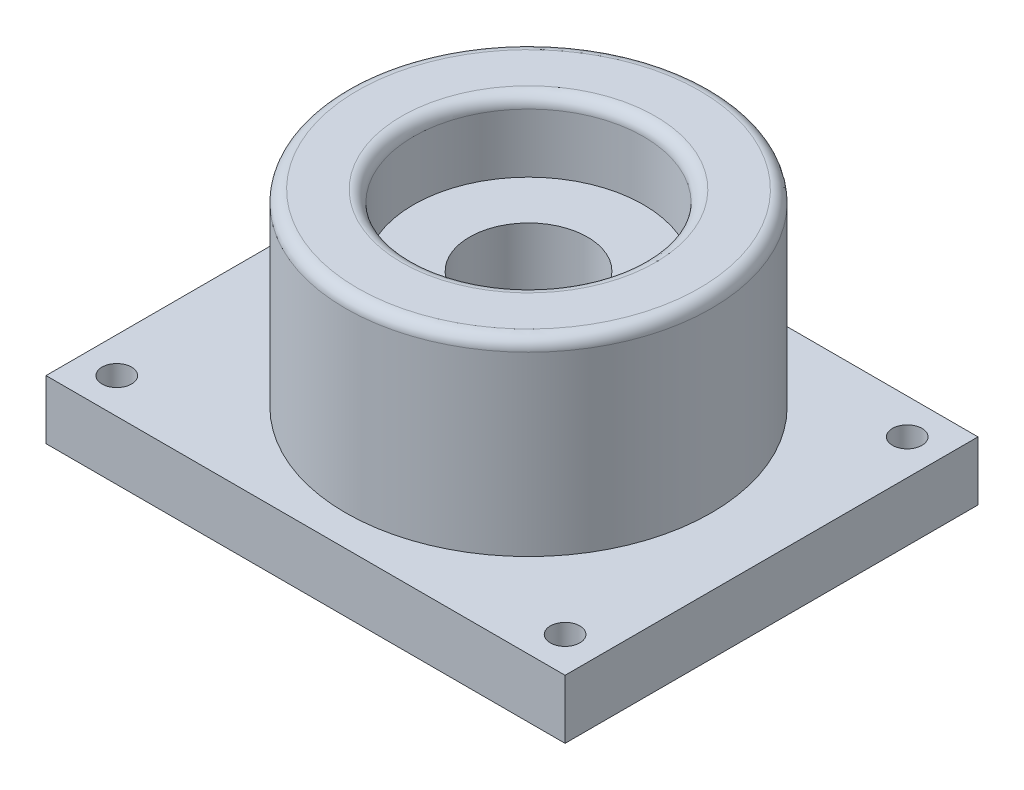
ISO-10303-21;
HEADER;
FILE_DESCRIPTION(('STEP AP214'),'2;1');
FILE_NAME('part.step','',(''),(''),'','','');
FILE_SCHEMA(('AUTOMOTIVE_DESIGN { 1 0 10303 214 1 1 1 1 }'));
ENDSEC;
DATA;
#1=APPLICATION_CONTEXT('core data for automotive mechanical design processes');
#2=APPLICATION_PROTOCOL_DEFINITION('international standard','automotive_design',2000,#1);
#3=PRODUCT_CONTEXT('',#1,'mechanical');
#4=PRODUCT('Part','Part','',(#3));
#5=PRODUCT_RELATED_PRODUCT_CATEGORY('part','',(#4));
#6=PRODUCT_DEFINITION_FORMATION('','',#4);
#7=PRODUCT_DEFINITION_CONTEXT('part definition',#1,'design');
#8=PRODUCT_DEFINITION('design','',#6,#7);
#9=PRODUCT_DEFINITION_SHAPE('','',#8);
#10=(LENGTH_UNIT() NAMED_UNIT(*) SI_UNIT(.MILLI.,.METRE.));
#11=(NAMED_UNIT(*) PLANE_ANGLE_UNIT() SI_UNIT($,.RADIAN.));
#12=(NAMED_UNIT(*) SI_UNIT($,.STERADIAN.) SOLID_ANGLE_UNIT());
#13=UNCERTAINTY_MEASURE_WITH_UNIT(LENGTH_MEASURE(1.E-05),#10,'distance_accuracy_value','');
#14=(GEOMETRIC_REPRESENTATION_CONTEXT(3) GLOBAL_UNCERTAINTY_ASSIGNED_CONTEXT((#13)) GLOBAL_UNIT_ASSIGNED_CONTEXT((#10,
#11,#12)) REPRESENTATION_CONTEXT('',''));
#15=CARTESIAN_POINT('',(0.,0.,0.));
#16=DIRECTION('',(0.,0.,1.));
#17=DIRECTION('',(1.,0.,0.));
#18=AXIS2_PLACEMENT_3D('',#15,#16,#17);
#19=CARTESIAN_POINT('',(0.,16.,0.));
#20=DIRECTION('',(0.,-1.,0.));
#21=DIRECTION('',(0.,0.,-1.));
#22=AXIS2_PLACEMENT_3D('',#19,#20,#21);
#23=CYLINDRICAL_SURFACE('',#22,15.5);
#24=CARTESIAN_POINT('',(0.,15.,0.));
#25=DIRECTION('',(0.,1.,0.));
#26=DIRECTION('',(0.,0.,1.));
#27=AXIS2_PLACEMENT_3D('',#24,#25,#26);
#28=CIRCLE('',#27,15.5);
#29=CARTESIAN_POINT('',(0.,15.,15.5));
#30=VERTEX_POINT('',#29);
#31=EDGE_CURVE('E11',#30,#30,#28,.F.);
#32=ORIENTED_EDGE('',*,*,#31,.T.);
#33=EDGE_LOOP('',(#32));
#34=FACE_BOUND('',#33,.T.);
#35=CARTESIAN_POINT('',(0.,0.,0.));
#36=DIRECTION('',(0.,1.,0.));
#37=DIRECTION('',(0.,0.,1.));
#38=AXIS2_PLACEMENT_3D('',#35,#36,#37);
#39=CIRCLE('',#38,15.5);
#40=CARTESIAN_POINT('',(0.,0.,15.5));
#41=VERTEX_POINT('',#40);
#42=EDGE_CURVE('E112',#41,#41,#39,.T.);
#43=ORIENTED_EDGE('',*,*,#42,.T.);
#44=EDGE_LOOP('',(#43));
#45=FACE_BOUND('',#44,.T.);
#46=ADVANCED_FACE('F33',(#34,#45),#23,.T.);
#47=CARTESIAN_POINT('',(0.,16.,0.));
#48=DIRECTION('',(0.,1.,0.));
#49=DIRECTION('',(0.,0.,1.));
#50=AXIS2_PLACEMENT_3D('',#47,#48,#49);
#51=PLANE('',#50);
#52=CARTESIAN_POINT('',(0.,16.,0.));
#53=DIRECTION('',(0.,1.,0.));
#54=DIRECTION('',(0.,0.,1.));
#55=AXIS2_PLACEMENT_3D('',#52,#53,#54);
#56=CIRCLE('',#55,14.5);
#57=CARTESIAN_POINT('',(0.,16.,14.5));
#58=VERTEX_POINT('',#57);
#59=EDGE_CURVE('E42',#58,#58,#56,.T.);
#60=ORIENTED_EDGE('',*,*,#59,.T.);
#61=EDGE_LOOP('',(#60));
#62=FACE_BOUND('',#61,.T.);
#63=CARTESIAN_POINT('',(0.,16.,0.));
#64=DIRECTION('',(0.,1.,0.));
#65=DIRECTION('',(0.,0.,1.));
#66=AXIS2_PLACEMENT_3D('',#63,#64,#65);
#67=CIRCLE('',#66,10.75);
#68=CARTESIAN_POINT('',(0.,16.,10.75));
#69=VERTEX_POINT('',#68);
#70=EDGE_CURVE('E123',#69,#69,#67,.F.);
#71=ORIENTED_EDGE('',*,*,#70,.T.);
#72=EDGE_LOOP('',(#71));
#73=FACE_BOUND('',#72,.T.);
#74=ADVANCED_FACE('F128',(#62,#73),#51,.T.);
#75=CARTESIAN_POINT('',(0.,-5.,0.));
#76=DIRECTION('',(0.,-1.,0.));
#77=DIRECTION('',(0.,0.,-1.));
#78=AXIS2_PLACEMENT_3D('',#75,#76,#77);
#79=PLANE('',#78);
#80=CARTESIAN_POINT('',(0.,-5.,0.));
#81=DIRECTION('',(0.,-1.,0.));
#82=DIRECTION('',(0.,0.,-1.));
#83=AXIS2_PLACEMENT_3D('',#80,#81,#82);
#84=CIRCLE('',#83,5.);
#85=CARTESIAN_POINT('',(0.,-5.,-5.));
#86=VERTEX_POINT('',#85);
#87=EDGE_CURVE('E116',#86,#86,#84,.T.);
#88=ORIENTED_EDGE('',*,*,#87,.F.);
#89=EDGE_LOOP('',(#88));
#90=FACE_BOUND('',#89,.T.);
#91=CARTESIAN_POINT('',(18.220707153394,-5.,15.1198920370729));
#92=DIRECTION('',(0.,-1.,0.));
#93=DIRECTION('',(0.,0.,-1.));
#94=AXIS2_PLACEMENT_3D('',#91,#92,#93);
#95=CIRCLE('',#94,1.25);
#96=CARTESIAN_POINT('',(18.220707153394,-5.,13.8698920370729));
#97=VERTEX_POINT('',#96);
#98=EDGE_CURVE('E210',#97,#97,#95,.T.);
#99=ORIENTED_EDGE('',*,*,#98,.F.);
#100=EDGE_LOOP('',(#99));
#101=FACE_BOUND('',#100,.T.);
#102=CARTESIAN_POINT('',(-19.7792928466059,-5.,-13.8801079629271));
#103=DIRECTION('',(0.,-1.,0.));
#104=DIRECTION('',(0.,0.,-1.));
#105=AXIS2_PLACEMENT_3D('',#102,#103,#104);
#106=CIRCLE('',#105,1.25);
#107=CARTESIAN_POINT('',(-19.7792928466059,-5.,-15.1301079629271));
#108=VERTEX_POINT('',#107);
#109=EDGE_CURVE('E105',#108,#108,#106,.T.);
#110=ORIENTED_EDGE('',*,*,#109,.F.);
#111=EDGE_LOOP('',(#110));
#112=FACE_BOUND('',#111,.T.);
#113=DIRECTION('',(0.,0.,1.));
#114=VECTOR('',#113,1.);
#115=CARTESIAN_POINT('',(21.2207071533941,-5.,18.1198920370729));
#116=LINE('',#115,#114);
#117=CARTESIAN_POINT('',(21.2207071533941,-5.,-16.8801079629271));
#118=VERTEX_POINT('',#117);
#119=CARTESIAN_POINT('',(21.2207071533941,-5.,18.1198920370729));
#120=VERTEX_POINT('',#119);
#121=EDGE_CURVE('E87',#118,#120,#116,.T.);
#122=ORIENTED_EDGE('',*,*,#121,.T.);
#123=DIRECTION('',(-1.,0.,0.));
#124=VECTOR('',#123,1.);
#125=CARTESIAN_POINT('',(-22.7792928466059,-5.,18.1198920370729));
#126=LINE('',#125,#124);
#127=CARTESIAN_POINT('',(-22.7792928466059,-5.,18.1198920370729));
#128=VERTEX_POINT('',#127);
#129=EDGE_CURVE('E81',#120,#128,#126,.T.);
#130=ORIENTED_EDGE('',*,*,#129,.T.);
#131=DIRECTION('',(0.,0.,-1.));
#132=VECTOR('',#131,1.);
#133=CARTESIAN_POINT('',(-22.7792928466059,-5.,18.1198920370729));
#134=LINE('',#133,#132);
#135=CARTESIAN_POINT('',(-22.7792928466059,-5.,-16.8801079629271));
#136=VERTEX_POINT('',#135);
#137=EDGE_CURVE('E85',#128,#136,#134,.T.);
#138=ORIENTED_EDGE('',*,*,#137,.T.);
#139=DIRECTION('',(1.,0.,0.));
#140=VECTOR('',#139,1.);
#141=CARTESIAN_POINT('',(-22.7792928466059,-5.,-16.8801079629271));
#142=LINE('',#141,#140);
#143=EDGE_CURVE('E50',#136,#118,#142,.T.);
#144=ORIENTED_EDGE('',*,*,#143,.T.);
#145=EDGE_LOOP('',(#122,#130,#138,#144));
#146=FACE_BOUND('',#145,.T.);
#147=CARTESIAN_POINT('',(18.2207071533941,-5.,-13.8801079629271));
#148=DIRECTION('',(0.,-1.,0.));
#149=DIRECTION('',(0.,0.,-1.));
#150=AXIS2_PLACEMENT_3D('',#147,#148,#149);
#151=CIRCLE('',#150,1.25);
#152=CARTESIAN_POINT('',(18.2207071533941,-5.,-15.1301079629271));
#153=VERTEX_POINT('',#152);
#154=EDGE_CURVE('E216',#153,#153,#151,.T.);
#155=ORIENTED_EDGE('',*,*,#154,.F.);
#156=EDGE_LOOP('',(#155));
#157=FACE_BOUND('',#156,.T.);
#158=CARTESIAN_POINT('',(-19.779292846606,-5.,15.1198920370729));
#159=DIRECTION('',(0.,-1.,0.));
#160=DIRECTION('',(0.,0.,-1.));
#161=AXIS2_PLACEMENT_3D('',#158,#159,#160);
#162=CIRCLE('',#161,1.25);
#163=CARTESIAN_POINT('',(-19.779292846606,-5.,13.8698920370729));
#164=VERTEX_POINT('',#163);
#165=EDGE_CURVE('E204',#164,#164,#162,.T.);
#166=ORIENTED_EDGE('',*,*,#165,.F.);
#167=EDGE_LOOP('',(#166));
#168=FACE_BOUND('',#167,.T.);
#169=ADVANCED_FACE('F82',(#90,#101,#112,#146,#157,#168),#79,.T.);
#170=CARTESIAN_POINT('',(0.,0.,0.));
#171=DIRECTION('',(0.,-1.,0.));
#172=DIRECTION('',(0.,0.,-1.));
#173=AXIS2_PLACEMENT_3D('',#170,#171,#172);
#174=PLANE('',#173);
#175=ORIENTED_EDGE('',*,*,#42,.F.);
#176=EDGE_LOOP('',(#175));
#177=FACE_BOUND('',#176,.T.);
#178=DIRECTION('',(0.,0.,1.));
#179=VECTOR('',#178,1.);
#180=CARTESIAN_POINT('',(21.2207071533941,0.,18.1198920370729));
#181=LINE('',#180,#179);
#182=CARTESIAN_POINT('',(21.2207071533941,0.,-16.8801079629271));
#183=VERTEX_POINT('',#182);
#184=CARTESIAN_POINT('',(21.2207071533941,0.,18.1198920370729));
#185=VERTEX_POINT('',#184);
#186=EDGE_CURVE('E102',#183,#185,#181,.T.);
#187=ORIENTED_EDGE('',*,*,#186,.F.);
#188=DIRECTION('',(1.,0.,0.));
#189=VECTOR('',#188,1.);
#190=CARTESIAN_POINT('',(-22.7792928466059,0.,-16.8801079629271));
#191=LINE('',#190,#189);
#192=CARTESIAN_POINT('',(-22.7792928466059,0.,-16.8801079629271));
#193=VERTEX_POINT('',#192);
#194=EDGE_CURVE('E73',#193,#183,#191,.T.);
#195=ORIENTED_EDGE('',*,*,#194,.F.);
#196=DIRECTION('',(0.,0.,-1.));
#197=VECTOR('',#196,1.);
#198=CARTESIAN_POINT('',(-22.7792928466059,0.,18.1198920370729));
#199=LINE('',#198,#197);
#200=CARTESIAN_POINT('',(-22.7792928466059,0.,18.1198920370729));
#201=VERTEX_POINT('',#200);
#202=EDGE_CURVE('E67',#201,#193,#199,.T.);
#203=ORIENTED_EDGE('',*,*,#202,.F.);
#204=DIRECTION('',(-1.,0.,0.));
#205=VECTOR('',#204,1.);
#206=CARTESIAN_POINT('',(-22.7792928466059,0.,18.1198920370729));
#207=LINE('',#206,#205);
#208=EDGE_CURVE('E92',#185,#201,#207,.T.);
#209=ORIENTED_EDGE('',*,*,#208,.F.);
#210=EDGE_LOOP('',(#187,#195,#203,#209));
#211=FACE_BOUND('',#210,.T.);
#212=CARTESIAN_POINT('',(-19.7792928466059,0.,-13.8801079629271));
#213=DIRECTION('',(0.,-1.,0.));
#214=DIRECTION('',(0.,0.,-1.));
#215=AXIS2_PLACEMENT_3D('',#212,#213,#214);
#216=CIRCLE('',#215,1.25);
#217=CARTESIAN_POINT('',(-19.7792928466059,0.,-15.1301079629271));
#218=VERTEX_POINT('',#217);
#219=EDGE_CURVE('E219',#218,#218,#216,.T.);
#220=ORIENTED_EDGE('',*,*,#219,.T.);
#221=EDGE_LOOP('',(#220));
#222=FACE_BOUND('',#221,.T.);
#223=CARTESIAN_POINT('',(18.2207071533941,0.,-13.8801079629271));
#224=DIRECTION('',(0.,-1.,0.));
#225=DIRECTION('',(0.,0.,-1.));
#226=AXIS2_PLACEMENT_3D('',#223,#224,#225);
#227=CIRCLE('',#226,1.25);
#228=CARTESIAN_POINT('',(18.2207071533941,0.,-15.1301079629271));
#229=VERTEX_POINT('',#228);
#230=EDGE_CURVE('E213',#229,#229,#227,.T.);
#231=ORIENTED_EDGE('',*,*,#230,.T.);
#232=EDGE_LOOP('',(#231));
#233=FACE_BOUND('',#232,.T.);
#234=CARTESIAN_POINT('',(18.220707153394,0.,15.1198920370729));
#235=DIRECTION('',(0.,-1.,0.));
#236=DIRECTION('',(0.,0.,-1.));
#237=AXIS2_PLACEMENT_3D('',#234,#235,#236);
#238=CIRCLE('',#237,1.25);
#239=CARTESIAN_POINT('',(18.220707153394,0.,13.8698920370729));
#240=VERTEX_POINT('',#239);
#241=EDGE_CURVE('E207',#240,#240,#238,.T.);
#242=ORIENTED_EDGE('',*,*,#241,.T.);
#243=EDGE_LOOP('',(#242));
#244=FACE_BOUND('',#243,.T.);
#245=CARTESIAN_POINT('',(-19.779292846606,0.,15.1198920370729));
#246=DIRECTION('',(0.,-1.,0.));
#247=DIRECTION('',(0.,0.,-1.));
#248=AXIS2_PLACEMENT_3D('',#245,#246,#247);
#249=CIRCLE('',#248,1.25);
#250=CARTESIAN_POINT('',(-19.779292846606,0.,13.8698920370729));
#251=VERTEX_POINT('',#250);
#252=EDGE_CURVE('E203',#251,#251,#249,.T.);
#253=ORIENTED_EDGE('',*,*,#252,.T.);
#254=EDGE_LOOP('',(#253));
#255=FACE_BOUND('',#254,.T.);
#256=ADVANCED_FACE('F152',(#177,#211,#222,#233,#244,#255),#174,.F.);
#257=CARTESIAN_POINT('',(21.2207071533941,-5.,18.1198920370729));
#258=DIRECTION('',(-1.,0.,0.));
#259=DIRECTION('',(0.,0.,1.));
#260=AXIS2_PLACEMENT_3D('',#257,#258,#259);
#261=PLANE('',#260);
#262=ORIENTED_EDGE('',*,*,#186,.T.);
#263=DIRECTION('',(0.,1.,0.));
#264=VECTOR('',#263,1.);
#265=CARTESIAN_POINT('',(21.2207071533941,-5.,18.1198920370729));
#266=LINE('',#265,#264);
#267=EDGE_CURVE('E93',#120,#185,#266,.T.);
#268=ORIENTED_EDGE('',*,*,#267,.F.);
#269=ORIENTED_EDGE('',*,*,#121,.F.);
#270=DIRECTION('',(0.,1.,0.));
#271=VECTOR('',#270,1.);
#272=CARTESIAN_POINT('',(21.2207071533941,-5.,-16.8801079629271));
#273=LINE('',#272,#271);
#274=EDGE_CURVE('E98',#118,#183,#273,.T.);
#275=ORIENTED_EDGE('',*,*,#274,.T.);
#276=EDGE_LOOP('',(#262,#268,#269,#275));
#277=FACE_BOUND('',#276,.T.);
#278=ADVANCED_FACE('F149',(#277),#261,.F.);
#279=CARTESIAN_POINT('',(-22.7792928466059,-5.,18.1198920370729));
#280=DIRECTION('',(0.,0.,-1.));
#281=DIRECTION('',(-1.,0.,0.));
#282=AXIS2_PLACEMENT_3D('',#279,#280,#281);
#283=PLANE('',#282);
#284=ORIENTED_EDGE('',*,*,#208,.T.);
#285=DIRECTION('',(0.,1.,0.));
#286=VECTOR('',#285,1.);
#287=CARTESIAN_POINT('',(-22.7792928466059,-5.,18.1198920370729));
#288=LINE('',#287,#286);
#289=EDGE_CURVE('E90',#128,#201,#288,.T.);
#290=ORIENTED_EDGE('',*,*,#289,.F.);
#291=ORIENTED_EDGE('',*,*,#129,.F.);
#292=ORIENTED_EDGE('',*,*,#267,.T.);
#293=EDGE_LOOP('',(#284,#290,#291,#292));
#294=FACE_BOUND('',#293,.T.);
#295=ADVANCED_FACE('F91',(#294),#283,.F.);
#296=CARTESIAN_POINT('',(-22.7792928466059,-5.,18.1198920370729));
#297=DIRECTION('',(1.,0.,0.));
#298=DIRECTION('',(0.,0.,-1.));
#299=AXIS2_PLACEMENT_3D('',#296,#297,#298);
#300=PLANE('',#299);
#301=ORIENTED_EDGE('',*,*,#202,.T.);
#302=DIRECTION('',(0.,1.,0.));
#303=VECTOR('',#302,1.);
#304=CARTESIAN_POINT('',(-22.7792928466059,-5.,-16.8801079629271));
#305=LINE('',#304,#303);
#306=EDGE_CURVE('E94',#136,#193,#305,.T.);
#307=ORIENTED_EDGE('',*,*,#306,.F.);
#308=ORIENTED_EDGE('',*,*,#137,.F.);
#309=ORIENTED_EDGE('',*,*,#289,.T.);
#310=EDGE_LOOP('',(#301,#307,#308,#309));
#311=FACE_BOUND('',#310,.T.);
#312=ADVANCED_FACE('F96',(#311),#300,.F.);
#313=CARTESIAN_POINT('',(-22.7792928466059,-5.,-16.8801079629271));
#314=DIRECTION('',(0.,0.,1.));
#315=DIRECTION('',(1.,0.,0.));
#316=AXIS2_PLACEMENT_3D('',#313,#314,#315);
#317=PLANE('',#316);
#318=ORIENTED_EDGE('',*,*,#194,.T.);
#319=ORIENTED_EDGE('',*,*,#274,.F.);
#320=ORIENTED_EDGE('',*,*,#143,.F.);
#321=ORIENTED_EDGE('',*,*,#306,.T.);
#322=EDGE_LOOP('',(#318,#319,#320,#321));
#323=FACE_BOUND('',#322,.T.);
#324=ADVANCED_FACE('F158',(#323),#317,.F.);
#325=CARTESIAN_POINT('',(-19.7792928466059,-5.,-13.8801079629271));
#326=DIRECTION('',(0.,1.,0.));
#327=DIRECTION('',(0.,0.,1.));
#328=AXIS2_PLACEMENT_3D('',#325,#326,#327);
#329=CYLINDRICAL_SURFACE('',#328,1.25);
#330=ORIENTED_EDGE('',*,*,#109,.T.);
#331=EDGE_LOOP('',(#330));
#332=FACE_BOUND('',#331,.T.);
#333=ORIENTED_EDGE('',*,*,#219,.F.);
#334=EDGE_LOOP('',(#333));
#335=FACE_BOUND('',#334,.T.);
#336=ADVANCED_FACE('F161',(#332,#335),#329,.F.);
#337=CARTESIAN_POINT('',(18.2207071533941,-5.,-13.8801079629271));
#338=DIRECTION('',(0.,1.,0.));
#339=DIRECTION('',(0.,0.,1.));
#340=AXIS2_PLACEMENT_3D('',#337,#338,#339);
#341=CYLINDRICAL_SURFACE('',#340,1.25);
#342=ORIENTED_EDGE('',*,*,#154,.T.);
#343=EDGE_LOOP('',(#342));
#344=FACE_BOUND('',#343,.T.);
#345=ORIENTED_EDGE('',*,*,#230,.F.);
#346=EDGE_LOOP('',(#345));
#347=FACE_BOUND('',#346,.T.);
#348=ADVANCED_FACE('F170',(#344,#347),#341,.F.);
#349=CARTESIAN_POINT('',(18.220707153394,-5.,15.1198920370729));
#350=DIRECTION('',(0.,1.,0.));
#351=DIRECTION('',(0.,0.,1.));
#352=AXIS2_PLACEMENT_3D('',#349,#350,#351);
#353=CYLINDRICAL_SURFACE('',#352,1.25);
#354=ORIENTED_EDGE('',*,*,#98,.T.);
#355=EDGE_LOOP('',(#354));
#356=FACE_BOUND('',#355,.T.);
#357=ORIENTED_EDGE('',*,*,#241,.F.);
#358=EDGE_LOOP('',(#357));
#359=FACE_BOUND('',#358,.T.);
#360=ADVANCED_FACE('F174',(#356,#359),#353,.F.);
#361=CARTESIAN_POINT('',(-19.779292846606,-5.,15.1198920370729));
#362=DIRECTION('',(0.,1.,0.));
#363=DIRECTION('',(0.,0.,1.));
#364=AXIS2_PLACEMENT_3D('',#361,#362,#363);
#365=CYLINDRICAL_SURFACE('',#364,1.25);
#366=ORIENTED_EDGE('',*,*,#165,.T.);
#367=EDGE_LOOP('',(#366));
#368=FACE_BOUND('',#367,.T.);
#369=ORIENTED_EDGE('',*,*,#252,.F.);
#370=EDGE_LOOP('',(#369));
#371=FACE_BOUND('',#370,.T.);
#372=ADVANCED_FACE('F178',(#368,#371),#365,.F.);
#373=CARTESIAN_POINT('',(0.,10.,0.));
#374=DIRECTION('',(0.,1.,0.));
#375=DIRECTION('',(0.,0.,1.));
#376=AXIS2_PLACEMENT_3D('',#373,#374,#375);
#377=CYLINDRICAL_SURFACE('',#376,9.75);
#378=CARTESIAN_POINT('',(0.,15.,0.));
#379=DIRECTION('',(0.,1.,0.));
#380=DIRECTION('',(0.,0.,1.));
#381=AXIS2_PLACEMENT_3D('',#378,#379,#380);
#382=CIRCLE('',#381,9.75);
#383=CARTESIAN_POINT('',(0.,15.,9.75));
#384=VERTEX_POINT('',#383);
#385=EDGE_CURVE('E115',#384,#384,#382,.T.);
#386=ORIENTED_EDGE('',*,*,#385,.T.);
#387=EDGE_LOOP('',(#386));
#388=FACE_BOUND('',#387,.T.);
#389=CARTESIAN_POINT('',(0.,10.,0.));
#390=DIRECTION('',(0.,1.,0.));
#391=DIRECTION('',(0.,0.,1.));
#392=AXIS2_PLACEMENT_3D('',#389,#390,#391);
#393=CIRCLE('',#392,9.75);
#394=CARTESIAN_POINT('',(0.,10.,9.75));
#395=VERTEX_POINT('',#394);
#396=EDGE_CURVE('E119',#395,#395,#393,.T.);
#397=ORIENTED_EDGE('',*,*,#396,.F.);
#398=EDGE_LOOP('',(#397));
#399=FACE_BOUND('',#398,.T.);
#400=ADVANCED_FACE('F182',(#388,#399),#377,.F.);
#401=CARTESIAN_POINT('',(0.,10.,0.));
#402=DIRECTION('',(0.,1.,0.));
#403=DIRECTION('',(0.,0.,1.));
#404=AXIS2_PLACEMENT_3D('',#401,#402,#403);
#405=PLANE('',#404);
#406=CARTESIAN_POINT('',(0.,10.,0.));
#407=DIRECTION('',(0.,1.,0.));
#408=DIRECTION('',(0.,0.,1.));
#409=AXIS2_PLACEMENT_3D('',#406,#407,#408);
#410=CIRCLE('',#409,5.);
#411=CARTESIAN_POINT('',(0.,10.,5.));
#412=VERTEX_POINT('',#411);
#413=EDGE_CURVE('E120',#412,#412,#410,.T.);
#414=ORIENTED_EDGE('',*,*,#413,.F.);
#415=EDGE_LOOP('',(#414));
#416=FACE_BOUND('',#415,.T.);
#417=ORIENTED_EDGE('',*,*,#396,.T.);
#418=EDGE_LOOP('',(#417));
#419=FACE_BOUND('',#418,.T.);
#420=ADVANCED_FACE('F186',(#416,#419),#405,.T.);
#421=CARTESIAN_POINT('',(0.,-9.,0.));
#422=DIRECTION('',(0.,1.,0.));
#423=DIRECTION('',(0.,0.,1.));
#424=AXIS2_PLACEMENT_3D('',#421,#422,#423);
#425=CYLINDRICAL_SURFACE('',#424,5.);
#426=ORIENTED_EDGE('',*,*,#87,.T.);
#427=EDGE_LOOP('',(#426));
#428=FACE_BOUND('',#427,.T.);
#429=ORIENTED_EDGE('',*,*,#413,.T.);
#430=EDGE_LOOP('',(#429));
#431=FACE_BOUND('',#430,.T.);
#432=ADVANCED_FACE('F137',(#428,#431),#425,.F.);
#433=CARTESIAN_POINT('',(0.,15.,0.));
#434=DIRECTION('',(0.,1.,0.));
#435=DIRECTION('',(0.,0.,1.));
#436=AXIS2_PLACEMENT_3D('',#433,#434,#435);
#437=TOROIDAL_SURFACE('',#436,10.75,1.);
#438=ORIENTED_EDGE('',*,*,#70,.F.);
#439=EDGE_LOOP('',(#438));
#440=FACE_BOUND('',#439,.T.);
#441=ORIENTED_EDGE('',*,*,#385,.F.);
#442=EDGE_LOOP('',(#441));
#443=FACE_BOUND('',#442,.T.);
#444=ADVANCED_FACE('F132',(#440,#443),#437,.T.);
#445=CARTESIAN_POINT('',(0.,15.,0.));
#446=DIRECTION('',(0.,1.,0.));
#447=DIRECTION('',(0.,0.,1.));
#448=AXIS2_PLACEMENT_3D('',#445,#446,#447);
#449=TOROIDAL_SURFACE('',#448,14.5,1.);
#450=ORIENTED_EDGE('',*,*,#31,.F.);
#451=EDGE_LOOP('',(#450));
#452=FACE_BOUND('',#451,.T.);
#453=ORIENTED_EDGE('',*,*,#59,.F.);
#454=EDGE_LOOP('',(#453));
#455=FACE_BOUND('',#454,.T.);
#456=ADVANCED_FACE('F35',(#452,#455),#449,.T.);
#457=CLOSED_SHELL('',(#46,#74,#169,#256,#278,#295,#312,#324,#336,#348,#360,#372,#400,#420,#432,
#444,#456));
#458=MANIFOLD_SOLID_BREP('B2',#457);
#459=ADVANCED_BREP_SHAPE_REPRESENTATION('',(#18,#458),#14);
#460=SHAPE_DEFINITION_REPRESENTATION(#9,#459);
ENDSEC;
END-ISO-10303-21;
